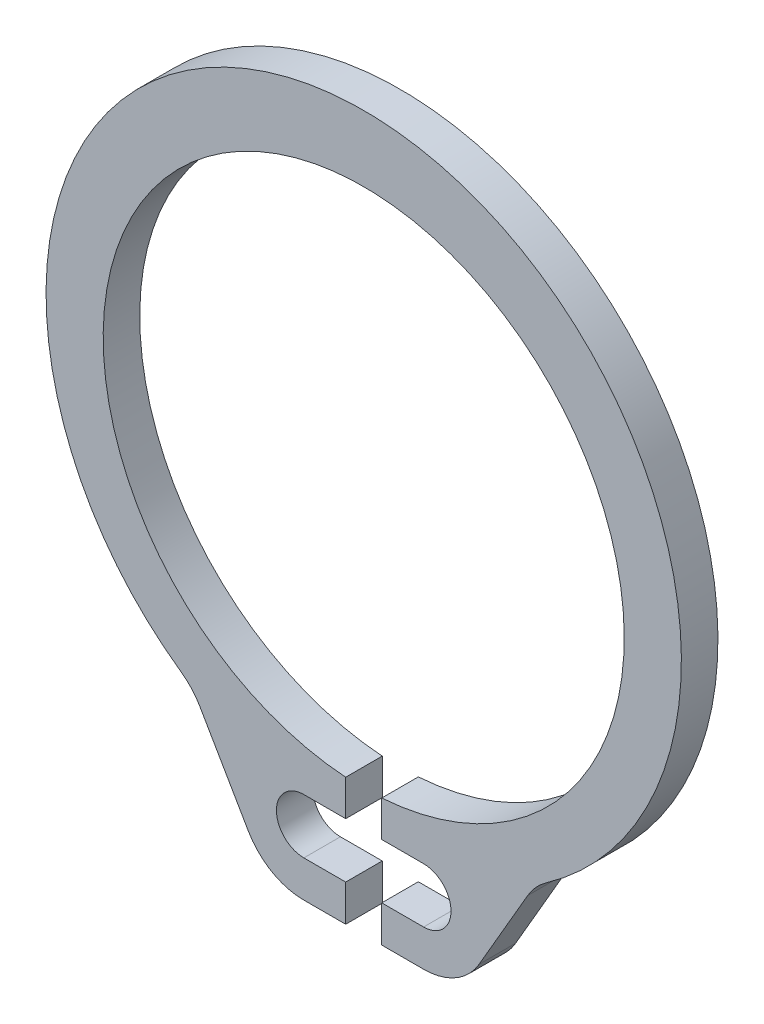
ISO-10303-21;
HEADER;
FILE_DESCRIPTION(('STEP AP214'),'2;1');
FILE_NAME('part.step','',(''),(''),'','','');
FILE_SCHEMA(('AUTOMOTIVE_DESIGN { 1 0 10303 214 1 1 1 1 }'));
ENDSEC;
DATA;
#1=APPLICATION_CONTEXT('core data for automotive mechanical design processes');
#2=APPLICATION_PROTOCOL_DEFINITION('international standard','automotive_design',2000,#1);
#3=PRODUCT_CONTEXT('',#1,'mechanical');
#4=PRODUCT('Part','Part','',(#3));
#5=PRODUCT_RELATED_PRODUCT_CATEGORY('part','',(#4));
#6=PRODUCT_DEFINITION_FORMATION('','',#4);
#7=PRODUCT_DEFINITION_CONTEXT('part definition',#1,'design');
#8=PRODUCT_DEFINITION('design','',#6,#7);
#9=PRODUCT_DEFINITION_SHAPE('','',#8);
#10=(LENGTH_UNIT() NAMED_UNIT(*) SI_UNIT(.MILLI.,.METRE.));
#11=(NAMED_UNIT(*) PLANE_ANGLE_UNIT() SI_UNIT($,.RADIAN.));
#12=(NAMED_UNIT(*) SI_UNIT($,.STERADIAN.) SOLID_ANGLE_UNIT());
#13=UNCERTAINTY_MEASURE_WITH_UNIT(LENGTH_MEASURE(1.E-05),#10,'distance_accuracy_value','');
#14=(GEOMETRIC_REPRESENTATION_CONTEXT(3) GLOBAL_UNCERTAINTY_ASSIGNED_CONTEXT((#13)) GLOBAL_UNIT_ASSIGNED_CONTEXT((#10,
#11,#12)) REPRESENTATION_CONTEXT('',''));
#15=CARTESIAN_POINT('',(0.,0.,0.));
#16=DIRECTION('',(0.,0.,1.));
#17=DIRECTION('',(1.,0.,0.));
#18=AXIS2_PLACEMENT_3D('',#15,#16,#17);
#19=CARTESIAN_POINT('',(-0.197180873665502,-2.84317071296477,0.2));
#20=DIRECTION('',(1.,0.,0.));
#21=DIRECTION('',(0.,0.,-1.));
#22=AXIS2_PLACEMENT_3D('',#19,#20,#21);
#23=PLANE('',#22);
#24=DIRECTION('',(0.,-1.,0.));
#25=VECTOR('',#24,1.);
#26=CARTESIAN_POINT('',(-0.197180873665502,-2.84317071296477,-0.2));
#27=LINE('',#26,#25);
#28=CARTESIAN_POINT('',(-0.1971808736655,-2.84317071296476,-0.2));
#29=VERTEX_POINT('',#28);
#30=CARTESIAN_POINT('',(-0.197180873665502,-3.23646186214265,-0.2));
#31=VERTEX_POINT('',#30);
#32=EDGE_CURVE('E294',#29,#31,#27,.T.);
#33=ORIENTED_EDGE('',*,*,#32,.F.);
#34=DIRECTION('',(0.,0.,-1.));
#35=VECTOR('',#34,1.);
#36=CARTESIAN_POINT('',(-0.1971808736655,-2.84317071296476,0.2));
#37=LINE('',#36,#35);
#38=CARTESIAN_POINT('',(-0.1971808736655,-2.84317071296476,0.2));
#39=VERTEX_POINT('',#38);
#40=EDGE_CURVE('E11',#39,#29,#37,.T.);
#41=ORIENTED_EDGE('',*,*,#40,.F.);
#42=DIRECTION('',(0.,-1.,0.));
#43=VECTOR('',#42,1.);
#44=CARTESIAN_POINT('',(-0.197180873665502,-2.84317071296477,0.2));
#45=LINE('',#44,#43);
#46=CARTESIAN_POINT('',(-0.197180873665502,-3.23646186214265,0.2));
#47=VERTEX_POINT('',#46);
#48=EDGE_CURVE('E225',#39,#47,#45,.T.);
#49=ORIENTED_EDGE('',*,*,#48,.T.);
#50=DIRECTION('',(0.,0.,-1.));
#51=VECTOR('',#50,1.);
#52=CARTESIAN_POINT('',(-0.197180873665502,-3.23646186214265,0.2));
#53=LINE('',#52,#51);
#54=EDGE_CURVE('E300',#47,#31,#53,.T.);
#55=ORIENTED_EDGE('',*,*,#54,.T.);
#56=EDGE_LOOP('',(#33,#41,#49,#55));
#57=FACE_BOUND('',#56,.T.);
#58=ADVANCED_FACE('F17',(#57),#23,.T.);
#59=CARTESIAN_POINT('',(0.,0.,0.2));
#60=DIRECTION('',(0.,0.,-1.));
#61=DIRECTION('',(-1.,0.,0.));
#62=AXIS2_PLACEMENT_3D('',#59,#60,#61);
#63=CYLINDRICAL_SURFACE('',#62,2.85);
#64=CARTESIAN_POINT('',(0.,0.,-0.2));
#65=DIRECTION('',(0.,0.,1.));
#66=DIRECTION('',(1.,0.,0.));
#67=AXIS2_PLACEMENT_3D('',#64,#65,#66);
#68=CIRCLE('',#67,2.85);
#69=CARTESIAN_POINT('',(0.197180873665501,-2.84317071296476,-0.2));
#70=VERTEX_POINT('',#69);
#71=EDGE_CURVE('E217',#70,#29,#68,.T.);
#72=ORIENTED_EDGE('',*,*,#71,.F.);
#73=DIRECTION('',(0.,0.,-1.));
#74=VECTOR('',#73,1.);
#75=CARTESIAN_POINT('',(0.197180873665501,-2.84317071296476,0.2));
#76=LINE('',#75,#74);
#77=CARTESIAN_POINT('',(0.197180873665501,-2.84317071296476,0.2));
#78=VERTEX_POINT('',#77);
#79=EDGE_CURVE('E20',#78,#70,#76,.T.);
#80=ORIENTED_EDGE('',*,*,#79,.F.);
#81=CARTESIAN_POINT('',(0.,0.,0.2));
#82=DIRECTION('',(0.,0.,1.));
#83=DIRECTION('',(1.,0.,0.));
#84=AXIS2_PLACEMENT_3D('',#81,#82,#83);
#85=CIRCLE('',#84,2.85);
#86=EDGE_CURVE('E297',#78,#39,#85,.T.);
#87=ORIENTED_EDGE('',*,*,#86,.T.);
#88=ORIENTED_EDGE('',*,*,#40,.T.);
#89=EDGE_LOOP('',(#72,#80,#87,#88));
#90=FACE_BOUND('',#89,.T.);
#91=ADVANCED_FACE('F223',(#90),#63,.F.);
#92=CARTESIAN_POINT('',(0.197180873665502,-2.84317071296477,0.2));
#93=DIRECTION('',(1.,0.,0.));
#94=DIRECTION('',(0.,0.,-1.));
#95=AXIS2_PLACEMENT_3D('',#92,#93,#94);
#96=PLANE('',#95);
#97=DIRECTION('',(0.,-1.,0.));
#98=VECTOR('',#97,1.);
#99=CARTESIAN_POINT('',(0.197180873665502,-2.84317071296477,-0.2));
#100=LINE('',#99,#98);
#101=CARTESIAN_POINT('',(0.197180873665502,-3.23646186214265,-0.2));
#102=VERTEX_POINT('',#101);
#103=EDGE_CURVE('E204',#70,#102,#100,.T.);
#104=ORIENTED_EDGE('',*,*,#103,.T.);
#105=DIRECTION('',(0.,0.,-1.));
#106=VECTOR('',#105,1.);
#107=CARTESIAN_POINT('',(0.197180873665502,-3.23646186214265,0.2));
#108=LINE('',#107,#106);
#109=CARTESIAN_POINT('',(0.197180873665502,-3.23646186214265,0.2));
#110=VERTEX_POINT('',#109);
#111=EDGE_CURVE('E212',#110,#102,#108,.T.);
#112=ORIENTED_EDGE('',*,*,#111,.F.);
#113=DIRECTION('',(0.,-1.,0.));
#114=VECTOR('',#113,1.);
#115=CARTESIAN_POINT('',(0.197180873665502,-2.84317071296477,0.2));
#116=LINE('',#115,#114);
#117=EDGE_CURVE('E206',#78,#110,#116,.T.);
#118=ORIENTED_EDGE('',*,*,#117,.F.);
#119=ORIENTED_EDGE('',*,*,#79,.T.);
#120=EDGE_LOOP('',(#104,#112,#118,#119));
#121=FACE_BOUND('',#120,.T.);
#122=ADVANCED_FACE('F202',(#121),#96,.F.);
#123=CARTESIAN_POINT('',(0.654781059878474,-3.23646186214265,0.2));
#124=DIRECTION('',(0.,-1.,0.));
#125=DIRECTION('',(0.,0.,-1.));
#126=AXIS2_PLACEMENT_3D('',#123,#124,#125);
#127=PLANE('',#126);
#128=DIRECTION('',(-1.,0.,0.));
#129=VECTOR('',#128,1.);
#130=CARTESIAN_POINT('',(0.654781059878474,-3.23646186214265,-0.2));
#131=LINE('',#130,#129);
#132=CARTESIAN_POINT('',(0.654781059878474,-3.23646186214265,-0.2));
#133=VERTEX_POINT('',#132);
#134=EDGE_CURVE('E220',#133,#102,#131,.T.);
#135=ORIENTED_EDGE('',*,*,#134,.F.);
#136=DIRECTION('',(0.,0.,-1.));
#137=VECTOR('',#136,1.);
#138=CARTESIAN_POINT('',(0.654781059878474,-3.23646186214265,0.2));
#139=LINE('',#138,#137);
#140=CARTESIAN_POINT('',(0.654781059878474,-3.23646186214265,0.2));
#141=VERTEX_POINT('',#140);
#142=EDGE_CURVE('E410',#141,#133,#139,.T.);
#143=ORIENTED_EDGE('',*,*,#142,.F.);
#144=DIRECTION('',(-1.,0.,0.));
#145=VECTOR('',#144,1.);
#146=CARTESIAN_POINT('',(0.654781059878474,-3.23646186214265,0.2));
#147=LINE('',#146,#145);
#148=EDGE_CURVE('E303',#141,#110,#147,.T.);
#149=ORIENTED_EDGE('',*,*,#148,.T.);
#150=ORIENTED_EDGE('',*,*,#111,.T.);
#151=EDGE_LOOP('',(#135,#143,#149,#150));
#152=FACE_BOUND('',#151,.T.);
#153=ADVANCED_FACE('F416',(#152),#127,.T.);
#154=CARTESIAN_POINT('',(0.654781059878474,-3.53646186214266,0.2));
#155=DIRECTION('',(0.,0.,-1.));
#156=DIRECTION('',(-1.,0.,0.));
#157=AXIS2_PLACEMENT_3D('',#154,#155,#156);
#158=CYLINDRICAL_SURFACE('',#157,0.3);
#159=CARTESIAN_POINT('',(0.654781059878474,-3.53646186214266,-0.2));
#160=DIRECTION('',(0.,0.,1.));
#161=DIRECTION('',(1.,0.,0.));
#162=AXIS2_PLACEMENT_3D('',#159,#160,#161);
#163=CIRCLE('',#162,0.3);
#164=CARTESIAN_POINT('',(0.654781059878474,-3.83646186214266,-0.2));
#165=VERTEX_POINT('',#164);
#166=EDGE_CURVE('E235',#165,#133,#163,.T.);
#167=ORIENTED_EDGE('',*,*,#166,.F.);
#168=DIRECTION('',(0.,0.,-1.));
#169=VECTOR('',#168,1.);
#170=CARTESIAN_POINT('',(0.654781059878474,-3.83646186214266,0.2));
#171=LINE('',#170,#169);
#172=CARTESIAN_POINT('',(0.654781059878474,-3.83646186214266,0.2));
#173=VERTEX_POINT('',#172);
#174=EDGE_CURVE('E407',#173,#165,#171,.T.);
#175=ORIENTED_EDGE('',*,*,#174,.F.);
#176=CARTESIAN_POINT('',(0.654781059878474,-3.53646186214266,0.2));
#177=DIRECTION('',(0.,0.,1.));
#178=DIRECTION('',(1.,0.,0.));
#179=AXIS2_PLACEMENT_3D('',#176,#177,#178);
#180=CIRCLE('',#179,0.3);
#181=EDGE_CURVE('E307',#173,#141,#180,.T.);
#182=ORIENTED_EDGE('',*,*,#181,.T.);
#183=ORIENTED_EDGE('',*,*,#142,.T.);
#184=EDGE_LOOP('',(#167,#175,#182,#183));
#185=FACE_BOUND('',#184,.T.);
#186=ADVANCED_FACE('F422',(#185),#158,.F.);
#187=CARTESIAN_POINT('',(0.654781059878474,-3.83646186214267,0.2));
#188=DIRECTION('',(0.,-1.,0.));
#189=DIRECTION('',(0.,0.,-1.));
#190=AXIS2_PLACEMENT_3D('',#187,#188,#189);
#191=PLANE('',#190);
#192=DIRECTION('',(-1.,0.,0.));
#193=VECTOR('',#192,1.);
#194=CARTESIAN_POINT('',(0.654781059878474,-3.83646186214267,-0.2));
#195=LINE('',#194,#193);
#196=CARTESIAN_POINT('',(0.197180873665502,-3.83646186214267,-0.2));
#197=VERTEX_POINT('',#196);
#198=EDGE_CURVE('E238',#165,#197,#195,.T.);
#199=ORIENTED_EDGE('',*,*,#198,.T.);
#200=DIRECTION('',(0.,0.,-1.));
#201=VECTOR('',#200,1.);
#202=CARTESIAN_POINT('',(0.197180873665502,-3.83646186214267,0.2));
#203=LINE('',#202,#201);
#204=CARTESIAN_POINT('',(0.197180873665502,-3.83646186214267,0.2));
#205=VERTEX_POINT('',#204);
#206=EDGE_CURVE('E403',#205,#197,#203,.T.);
#207=ORIENTED_EDGE('',*,*,#206,.F.);
#208=DIRECTION('',(-1.,0.,0.));
#209=VECTOR('',#208,1.);
#210=CARTESIAN_POINT('',(0.654781059878474,-3.83646186214267,0.2));
#211=LINE('',#210,#209);
#212=EDGE_CURVE('E311',#173,#205,#211,.T.);
#213=ORIENTED_EDGE('',*,*,#212,.F.);
#214=ORIENTED_EDGE('',*,*,#174,.T.);
#215=EDGE_LOOP('',(#199,#207,#213,#214));
#216=FACE_BOUND('',#215,.T.);
#217=ADVANCED_FACE('F427',(#216),#191,.F.);
#218=CARTESIAN_POINT('',(0.197180873665502,-3.83646186214264,0.2));
#219=DIRECTION('',(1.,0.,0.));
#220=DIRECTION('',(0.,0.,-1.));
#221=AXIS2_PLACEMENT_3D('',#218,#219,#220);
#222=PLANE('',#221);
#223=DIRECTION('',(0.,-1.,0.));
#224=VECTOR('',#223,1.);
#225=CARTESIAN_POINT('',(0.197180873665502,-3.83646186214264,-0.2));
#226=LINE('',#225,#224);
#227=CARTESIAN_POINT('',(0.197180873665502,-4.23650310489373,-0.2));
#228=VERTEX_POINT('',#227);
#229=EDGE_CURVE('E241',#197,#228,#226,.T.);
#230=ORIENTED_EDGE('',*,*,#229,.T.);
#231=DIRECTION('',(0.,0.,-1.));
#232=VECTOR('',#231,1.);
#233=CARTESIAN_POINT('',(0.197180873665502,-4.23650310489373,0.2));
#234=LINE('',#233,#232);
#235=CARTESIAN_POINT('',(0.197180873665502,-4.23650310489373,0.2));
#236=VERTEX_POINT('',#235);
#237=EDGE_CURVE('E399',#236,#228,#234,.T.);
#238=ORIENTED_EDGE('',*,*,#237,.F.);
#239=DIRECTION('',(0.,-1.,0.));
#240=VECTOR('',#239,1.);
#241=CARTESIAN_POINT('',(0.197180873665502,-3.83646186214264,0.2));
#242=LINE('',#241,#240);
#243=EDGE_CURVE('E314',#205,#236,#242,.T.);
#244=ORIENTED_EDGE('',*,*,#243,.F.);
#245=ORIENTED_EDGE('',*,*,#206,.T.);
#246=EDGE_LOOP('',(#230,#238,#244,#245));
#247=FACE_BOUND('',#246,.T.);
#248=ADVANCED_FACE('F433',(#247),#222,.F.);
#249=CARTESIAN_POINT('',(0.197180873665502,-4.23650310489373,0.2));
#250=DIRECTION('',(0.,1.,0.));
#251=DIRECTION('',(0.,0.,1.));
#252=AXIS2_PLACEMENT_3D('',#249,#250,#251);
#253=PLANE('',#252);
#254=DIRECTION('',(1.,0.,0.));
#255=VECTOR('',#254,1.);
#256=CARTESIAN_POINT('',(0.197180873665502,-4.23650310489373,-0.2));
#257=LINE('',#256,#255);
#258=CARTESIAN_POINT('',(0.655583102560456,-4.23650310489373,-0.2));
#259=VERTEX_POINT('',#258);
#260=EDGE_CURVE('E244',#228,#259,#257,.T.);
#261=ORIENTED_EDGE('',*,*,#260,.T.);
#262=DIRECTION('',(0.,0.,-1.));
#263=VECTOR('',#262,1.);
#264=CARTESIAN_POINT('',(0.655583102560456,-4.23650310489373,0.2));
#265=LINE('',#264,#263);
#266=CARTESIAN_POINT('',(0.655583102560456,-4.23650310489373,0.2));
#267=VERTEX_POINT('',#266);
#268=EDGE_CURVE('E395',#267,#259,#265,.T.);
#269=ORIENTED_EDGE('',*,*,#268,.F.);
#270=DIRECTION('',(1.,0.,0.));
#271=VECTOR('',#270,1.);
#272=CARTESIAN_POINT('',(0.197180873665502,-4.23650310489373,0.2));
#273=LINE('',#272,#271);
#274=EDGE_CURVE('E317',#236,#267,#273,.T.);
#275=ORIENTED_EDGE('',*,*,#274,.F.);
#276=ORIENTED_EDGE('',*,*,#237,.T.);
#277=EDGE_LOOP('',(#261,#269,#275,#276));
#278=FACE_BOUND('',#277,.T.);
#279=ADVANCED_FACE('F437',(#278),#253,.F.);
#280=CARTESIAN_POINT('',(0.655583102560456,-3.53650310489374,0.2));
#281=DIRECTION('',(0.,0.,-1.));
#282=DIRECTION('',(-1.,0.,0.));
#283=AXIS2_PLACEMENT_3D('',#280,#281,#282);
#284=CYLINDRICAL_SURFACE('',#283,0.7);
#285=CARTESIAN_POINT('',(0.655583102560456,-3.53650310489374,-0.2));
#286=DIRECTION('',(0.,0.,1.));
#287=DIRECTION('',(1.,0.,0.));
#288=AXIS2_PLACEMENT_3D('',#285,#286,#287);
#289=CIRCLE('',#288,0.7);
#290=CARTESIAN_POINT('',(1.26121867382212,-3.887509593185,-0.2));
#291=VERTEX_POINT('',#290);
#292=EDGE_CURVE('E247',#259,#291,#289,.T.);
#293=ORIENTED_EDGE('',*,*,#292,.T.);
#294=DIRECTION('',(0.,0.,-1.));
#295=VECTOR('',#294,1.);
#296=CARTESIAN_POINT('',(1.26121867382212,-3.887509593185,0.2));
#297=LINE('',#296,#295);
#298=CARTESIAN_POINT('',(1.26121867382212,-3.887509593185,0.2));
#299=VERTEX_POINT('',#298);
#300=EDGE_CURVE('E391',#299,#291,#297,.T.);
#301=ORIENTED_EDGE('',*,*,#300,.F.);
#302=CARTESIAN_POINT('',(0.655583102560456,-3.53650310489374,0.2));
#303=DIRECTION('',(0.,0.,1.));
#304=DIRECTION('',(1.,0.,0.));
#305=AXIS2_PLACEMENT_3D('',#302,#303,#304);
#306=CIRCLE('',#305,0.7);
#307=EDGE_CURVE('E320',#267,#299,#306,.T.);
#308=ORIENTED_EDGE('',*,*,#307,.F.);
#309=ORIENTED_EDGE('',*,*,#268,.T.);
#310=EDGE_LOOP('',(#293,#301,#308,#309));
#311=FACE_BOUND('',#310,.T.);
#312=ADVANCED_FACE('F442',(#311),#284,.T.);
#313=CARTESIAN_POINT('',(1.26121867382213,-3.887509593185,0.2));
#314=DIRECTION('',(-0.865193673230945,0.501437840416083,0.));
#315=DIRECTION('',(-0.501437840416083,-0.865193673230945,0.));
#316=AXIS2_PLACEMENT_3D('',#313,#314,#315);
#317=PLANE('',#316);
#318=DIRECTION('',(0.501437840416083,0.865193673230945,0.));
#319=VECTOR('',#318,1.);
#320=CARTESIAN_POINT('',(1.26121867382213,-3.887509593185,-0.2));
#321=LINE('',#320,#319);
#322=CARTESIAN_POINT('',(1.79425129082074,-2.96780148445859,-0.2));
#323=VERTEX_POINT('',#322);
#324=EDGE_CURVE('E250',#291,#323,#321,.T.);
#325=ORIENTED_EDGE('',*,*,#324,.T.);
#326=DIRECTION('',(0.,0.,-1.));
#327=VECTOR('',#326,1.);
#328=CARTESIAN_POINT('',(1.79425129082074,-2.96780148445859,0.2));
#329=LINE('',#328,#327);
#330=CARTESIAN_POINT('',(1.79425129082074,-2.96780148445859,0.2));
#331=VERTEX_POINT('',#330);
#332=EDGE_CURVE('E388',#331,#323,#329,.T.);
#333=ORIENTED_EDGE('',*,*,#332,.F.);
#334=DIRECTION('',(0.501437840416083,0.865193673230945,0.));
#335=VECTOR('',#334,1.);
#336=CARTESIAN_POINT('',(1.26121867382213,-3.887509593185,0.2));
#337=LINE('',#336,#335);
#338=EDGE_CURVE('E323',#299,#331,#337,.T.);
#339=ORIENTED_EDGE('',*,*,#338,.F.);
#340=ORIENTED_EDGE('',*,*,#300,.T.);
#341=EDGE_LOOP('',(#325,#333,#339,#340));
#342=FACE_BOUND('',#341,.T.);
#343=ADVANCED_FACE('F447',(#342),#317,.F.);
#344=CARTESIAN_POINT('',(2.39988686208238,-3.31880797274983,0.2));
#345=DIRECTION('',(0.,0.,-1.));
#346=DIRECTION('',(-1.,0.,0.));
#347=AXIS2_PLACEMENT_3D('',#344,#345,#346);
#348=CYLINDRICAL_SURFACE('',#347,0.7);
#349=CARTESIAN_POINT('',(2.39988686208238,-3.31880797274983,-0.2));
#350=DIRECTION('',(0.,0.,1.));
#351=DIRECTION('',(1.,0.,0.));
#352=AXIS2_PLACEMENT_3D('',#349,#350,#351);
#353=CIRCLE('',#352,0.7);
#354=CARTESIAN_POINT('',(1.99751062173317,-2.74601362815272,-0.2));
#355=VERTEX_POINT('',#354);
#356=EDGE_CURVE('E254',#355,#323,#353,.T.);
#357=ORIENTED_EDGE('',*,*,#356,.F.);
#358=DIRECTION('',(0.,0.,-1.));
#359=VECTOR('',#358,1.);
#360=CARTESIAN_POINT('',(1.99751062173317,-2.74601362815272,0.2));
#361=LINE('',#360,#359);
#362=CARTESIAN_POINT('',(1.99751062173317,-2.74601362815272,0.2));
#363=VERTEX_POINT('',#362);
#364=EDGE_CURVE('E385',#363,#355,#361,.T.);
#365=ORIENTED_EDGE('',*,*,#364,.F.);
#366=CARTESIAN_POINT('',(2.39988686208238,-3.31880797274983,0.2));
#367=DIRECTION('',(0.,0.,1.));
#368=DIRECTION('',(1.,0.,0.));
#369=AXIS2_PLACEMENT_3D('',#366,#367,#368);
#370=CIRCLE('',#369,0.7);
#371=EDGE_CURVE('E326',#363,#331,#370,.T.);
#372=ORIENTED_EDGE('',*,*,#371,.T.);
#373=ORIENTED_EDGE('',*,*,#332,.T.);
#374=EDGE_LOOP('',(#357,#365,#372,#373));
#375=FACE_BOUND('',#374,.T.);
#376=ADVANCED_FACE('F451',(#375),#348,.F.);
#377=CARTESIAN_POINT('',(0.,0.0975011539537434,0.2));
#378=DIRECTION('',(0.,0.,-1.));
#379=DIRECTION('',(-1.,0.,0.));
#380=AXIS2_PLACEMENT_3D('',#377,#378,#379);
#381=CYLINDRICAL_SURFACE('',#380,3.475);
#382=CARTESIAN_POINT('',(0.,0.0975011539537434,-0.2));
#383=DIRECTION('',(0.,0.,1.));
#384=DIRECTION('',(1.,0.,0.));
#385=AXIS2_PLACEMENT_3D('',#382,#383,#384);
#386=CIRCLE('',#385,3.475);
#387=CARTESIAN_POINT('',(-1.99751062173359,-2.74601362815334,-0.2));
#388=VERTEX_POINT('',#387);
#389=EDGE_CURVE('E258',#355,#388,#386,.T.);
#390=ORIENTED_EDGE('',*,*,#389,.T.);
#391=DIRECTION('',(0.,0.,-1.));
#392=VECTOR('',#391,1.);
#393=CARTESIAN_POINT('',(-1.99751062173359,-2.74601362815334,0.2));
#394=LINE('',#393,#392);
#395=CARTESIAN_POINT('',(-1.99751062173359,-2.74601362815334,0.2));
#396=VERTEX_POINT('',#395);
#397=EDGE_CURVE('E382',#396,#388,#394,.T.);
#398=ORIENTED_EDGE('',*,*,#397,.F.);
#399=CARTESIAN_POINT('',(0.,0.0975011539537434,0.2));
#400=DIRECTION('',(0.,0.,1.));
#401=DIRECTION('',(1.,0.,0.));
#402=AXIS2_PLACEMENT_3D('',#399,#400,#401);
#403=CIRCLE('',#402,3.475);
#404=EDGE_CURVE('E330',#363,#396,#403,.T.);
#405=ORIENTED_EDGE('',*,*,#404,.F.);
#406=ORIENTED_EDGE('',*,*,#364,.T.);
#407=EDGE_LOOP('',(#390,#398,#405,#406));
#408=FACE_BOUND('',#407,.T.);
#409=ADVANCED_FACE('F456',(#408),#381,.T.);
#410=CARTESIAN_POINT('',(-2.39988686208238,-3.31880797274983,0.2));
#411=DIRECTION('',(0.,0.,-1.));
#412=DIRECTION('',(-1.,0.,0.));
#413=AXIS2_PLACEMENT_3D('',#410,#411,#412);
#414=CYLINDRICAL_SURFACE('',#413,0.7);
#415=CARTESIAN_POINT('',(-2.39988686208238,-3.31880797274983,-0.2));
#416=DIRECTION('',(0.,0.,1.));
#417=DIRECTION('',(1.,0.,0.));
#418=AXIS2_PLACEMENT_3D('',#415,#416,#417);
#419=CIRCLE('',#418,0.7);
#420=CARTESIAN_POINT('',(-1.79425129082072,-2.96780148445858,-0.2));
#421=VERTEX_POINT('',#420);
#422=EDGE_CURVE('E262',#421,#388,#419,.T.);
#423=ORIENTED_EDGE('',*,*,#422,.F.);
#424=DIRECTION('',(0.,0.,-1.));
#425=VECTOR('',#424,1.);
#426=CARTESIAN_POINT('',(-1.79425129082072,-2.96780148445858,0.2));
#427=LINE('',#426,#425);
#428=CARTESIAN_POINT('',(-1.79425129082072,-2.96780148445858,0.2));
#429=VERTEX_POINT('',#428);
#430=EDGE_CURVE('E379',#429,#421,#427,.T.);
#431=ORIENTED_EDGE('',*,*,#430,.F.);
#432=CARTESIAN_POINT('',(-2.39988686208238,-3.31880797274983,0.2));
#433=DIRECTION('',(0.,0.,1.));
#434=DIRECTION('',(1.,0.,0.));
#435=AXIS2_PLACEMENT_3D('',#432,#433,#434);
#436=CIRCLE('',#435,0.7);
#437=EDGE_CURVE('E333',#429,#396,#436,.T.);
#438=ORIENTED_EDGE('',*,*,#437,.T.);
#439=ORIENTED_EDGE('',*,*,#397,.T.);
#440=EDGE_LOOP('',(#423,#431,#438,#439));
#441=FACE_BOUND('',#440,.T.);
#442=ADVANCED_FACE('F516',(#441),#414,.F.);
#443=CARTESIAN_POINT('',(-1.26121867382213,-3.887509593185,0.2));
#444=DIRECTION('',(-0.865193673230945,-0.501437840416083,0.));
#445=DIRECTION('',(0.501437840416083,-0.865193673230945,0.));
#446=AXIS2_PLACEMENT_3D('',#443,#444,#445);
#447=PLANE('',#446);
#448=DIRECTION('',(-0.501437840416083,0.865193673230945,0.));
#449=VECTOR('',#448,1.);
#450=CARTESIAN_POINT('',(-1.26121867382213,-3.887509593185,-0.2));
#451=LINE('',#450,#449);
#452=CARTESIAN_POINT('',(-1.26121867382213,-3.887509593185,-0.2));
#453=VERTEX_POINT('',#452);
#454=EDGE_CURVE('E266',#453,#421,#451,.T.);
#455=ORIENTED_EDGE('',*,*,#454,.F.);
#456=DIRECTION('',(0.,0.,-1.));
#457=VECTOR('',#456,1.);
#458=CARTESIAN_POINT('',(-1.26121867382213,-3.887509593185,0.2));
#459=LINE('',#458,#457);
#460=CARTESIAN_POINT('',(-1.26121867382213,-3.887509593185,0.2));
#461=VERTEX_POINT('',#460);
#462=EDGE_CURVE('E376',#461,#453,#459,.T.);
#463=ORIENTED_EDGE('',*,*,#462,.F.);
#464=DIRECTION('',(-0.501437840416083,0.865193673230945,0.));
#465=VECTOR('',#464,1.);
#466=CARTESIAN_POINT('',(-1.26121867382213,-3.887509593185,0.2));
#467=LINE('',#466,#465);
#468=EDGE_CURVE('E337',#461,#429,#467,.T.);
#469=ORIENTED_EDGE('',*,*,#468,.T.);
#470=ORIENTED_EDGE('',*,*,#430,.T.);
#471=EDGE_LOOP('',(#455,#463,#469,#470));
#472=FACE_BOUND('',#471,.T.);
#473=ADVANCED_FACE('F462',(#472),#447,.T.);
#474=CARTESIAN_POINT('',(-0.655583102560456,-3.53650310489374,0.2));
#475=DIRECTION('',(0.,0.,-1.));
#476=DIRECTION('',(-1.,0.,0.));
#477=AXIS2_PLACEMENT_3D('',#474,#475,#476);
#478=CYLINDRICAL_SURFACE('',#477,0.7);
#479=CARTESIAN_POINT('',(-0.655583102560456,-3.53650310489374,-0.2));
#480=DIRECTION('',(0.,0.,1.));
#481=DIRECTION('',(1.,0.,0.));
#482=AXIS2_PLACEMENT_3D('',#479,#480,#481);
#483=CIRCLE('',#482,0.7);
#484=CARTESIAN_POINT('',(-0.655583102560456,-4.23650310489374,-0.2));
#485=VERTEX_POINT('',#484);
#486=EDGE_CURVE('E270',#453,#485,#483,.T.);
#487=ORIENTED_EDGE('',*,*,#486,.T.);
#488=DIRECTION('',(0.,0.,-1.));
#489=VECTOR('',#488,1.);
#490=CARTESIAN_POINT('',(-0.655583102560456,-4.23650310489374,0.2));
#491=LINE('',#490,#489);
#492=CARTESIAN_POINT('',(-0.655583102560456,-4.23650310489374,0.2));
#493=VERTEX_POINT('',#492);
#494=EDGE_CURVE('E373',#493,#485,#491,.T.);
#495=ORIENTED_EDGE('',*,*,#494,.F.);
#496=CARTESIAN_POINT('',(-0.655583102560456,-3.53650310489374,0.2));
#497=DIRECTION('',(0.,0.,1.));
#498=DIRECTION('',(1.,0.,0.));
#499=AXIS2_PLACEMENT_3D('',#496,#497,#498);
#500=CIRCLE('',#499,0.7);
#501=EDGE_CURVE('E341',#461,#493,#500,.T.);
#502=ORIENTED_EDGE('',*,*,#501,.F.);
#503=ORIENTED_EDGE('',*,*,#462,.T.);
#504=EDGE_LOOP('',(#487,#495,#502,#503));
#505=FACE_BOUND('',#504,.T.);
#506=ADVANCED_FACE('F468',(#505),#478,.T.);
#507=CARTESIAN_POINT('',(-0.197180873665502,-4.23650310489373,0.2));
#508=DIRECTION('',(0.,-1.,0.));
#509=DIRECTION('',(0.,0.,-1.));
#510=AXIS2_PLACEMENT_3D('',#507,#508,#509);
#511=PLANE('',#510);
#512=DIRECTION('',(-1.,0.,0.));
#513=VECTOR('',#512,1.);
#514=CARTESIAN_POINT('',(-0.197180873665502,-4.23650310489373,-0.2));
#515=LINE('',#514,#513);
#516=CARTESIAN_POINT('',(-0.197180873665502,-4.23650310489373,-0.2));
#517=VERTEX_POINT('',#516);
#518=EDGE_CURVE('E274',#517,#485,#515,.T.);
#519=ORIENTED_EDGE('',*,*,#518,.F.);
#520=DIRECTION('',(0.,0.,-1.));
#521=VECTOR('',#520,1.);
#522=CARTESIAN_POINT('',(-0.197180873665502,-4.23650310489373,0.2));
#523=LINE('',#522,#521);
#524=CARTESIAN_POINT('',(-0.197180873665502,-4.23650310489373,0.2));
#525=VERTEX_POINT('',#524);
#526=EDGE_CURVE('E370',#525,#517,#523,.T.);
#527=ORIENTED_EDGE('',*,*,#526,.F.);
#528=DIRECTION('',(-1.,0.,0.));
#529=VECTOR('',#528,1.);
#530=CARTESIAN_POINT('',(-0.197180873665502,-4.23650310489373,0.2));
#531=LINE('',#530,#529);
#532=EDGE_CURVE('E344',#525,#493,#531,.T.);
#533=ORIENTED_EDGE('',*,*,#532,.T.);
#534=ORIENTED_EDGE('',*,*,#494,.T.);
#535=EDGE_LOOP('',(#519,#527,#533,#534));
#536=FACE_BOUND('',#535,.T.);
#537=ADVANCED_FACE('F523',(#536),#511,.T.);
#538=CARTESIAN_POINT('',(-0.197180873665502,-3.83646186214264,0.2));
#539=DIRECTION('',(1.,0.,0.));
#540=DIRECTION('',(0.,0.,-1.));
#541=AXIS2_PLACEMENT_3D('',#538,#539,#540);
#542=PLANE('',#541);
#543=DIRECTION('',(0.,-1.,0.));
#544=VECTOR('',#543,1.);
#545=CARTESIAN_POINT('',(-0.197180873665502,-3.83646186214264,-0.2));
#546=LINE('',#545,#544);
#547=CARTESIAN_POINT('',(-0.197180873665502,-3.83646186214264,-0.2));
#548=VERTEX_POINT('',#547);
#549=EDGE_CURVE('E278',#548,#517,#546,.T.);
#550=ORIENTED_EDGE('',*,*,#549,.F.);
#551=DIRECTION('',(0.,0.,-1.));
#552=VECTOR('',#551,1.);
#553=CARTESIAN_POINT('',(-0.197180873665502,-3.83646186214264,0.2));
#554=LINE('',#553,#552);
#555=CARTESIAN_POINT('',(-0.197180873665502,-3.83646186214264,0.2));
#556=VERTEX_POINT('',#555);
#557=EDGE_CURVE('E367',#556,#548,#554,.T.);
#558=ORIENTED_EDGE('',*,*,#557,.F.);
#559=DIRECTION('',(0.,-1.,0.));
#560=VECTOR('',#559,1.);
#561=CARTESIAN_POINT('',(-0.197180873665502,-3.83646186214264,0.2));
#562=LINE('',#561,#560);
#563=EDGE_CURVE('E348',#556,#525,#562,.T.);
#564=ORIENTED_EDGE('',*,*,#563,.T.);
#565=ORIENTED_EDGE('',*,*,#526,.T.);
#566=EDGE_LOOP('',(#550,#558,#564,#565));
#567=FACE_BOUND('',#566,.T.);
#568=ADVANCED_FACE('F475',(#567),#542,.T.);
#569=CARTESIAN_POINT('',(-0.654781059878474,-3.83646186214267,0.2));
#570=DIRECTION('',(0.,1.,0.));
#571=DIRECTION('',(0.,0.,1.));
#572=AXIS2_PLACEMENT_3D('',#569,#570,#571);
#573=PLANE('',#572);
#574=DIRECTION('',(1.,0.,0.));
#575=VECTOR('',#574,1.);
#576=CARTESIAN_POINT('',(-0.654781059878474,-3.83646186214267,-0.2));
#577=LINE('',#576,#575);
#578=CARTESIAN_POINT('',(-0.654781059878474,-3.83646186214267,-0.2));
#579=VERTEX_POINT('',#578);
#580=EDGE_CURVE('E282',#579,#548,#577,.T.);
#581=ORIENTED_EDGE('',*,*,#580,.F.);
#582=DIRECTION('',(0.,0.,-1.));
#583=VECTOR('',#582,1.);
#584=CARTESIAN_POINT('',(-0.654781059878474,-3.83646186214267,0.2));
#585=LINE('',#584,#583);
#586=CARTESIAN_POINT('',(-0.654781059878474,-3.83646186214267,0.2));
#587=VERTEX_POINT('',#586);
#588=EDGE_CURVE('E364',#587,#579,#585,.T.);
#589=ORIENTED_EDGE('',*,*,#588,.F.);
#590=DIRECTION('',(1.,0.,0.));
#591=VECTOR('',#590,1.);
#592=CARTESIAN_POINT('',(-0.654781059878474,-3.83646186214267,0.2));
#593=LINE('',#592,#591);
#594=EDGE_CURVE('E352',#587,#556,#593,.T.);
#595=ORIENTED_EDGE('',*,*,#594,.T.);
#596=ORIENTED_EDGE('',*,*,#557,.T.);
#597=EDGE_LOOP('',(#581,#589,#595,#596));
#598=FACE_BOUND('',#597,.T.);
#599=ADVANCED_FACE('F479',(#598),#573,.T.);
#600=CARTESIAN_POINT('',(-0.654781059878474,-3.53646186214266,0.2));
#601=DIRECTION('',(0.,0.,-1.));
#602=DIRECTION('',(-1.,0.,0.));
#603=AXIS2_PLACEMENT_3D('',#600,#601,#602);
#604=CYLINDRICAL_SURFACE('',#603,0.3);
#605=CARTESIAN_POINT('',(-0.654781059878474,-3.53646186214266,-0.2));
#606=DIRECTION('',(0.,0.,1.));
#607=DIRECTION('',(1.,0.,0.));
#608=AXIS2_PLACEMENT_3D('',#605,#606,#607);
#609=CIRCLE('',#608,0.3);
#610=CARTESIAN_POINT('',(-0.654781059878474,-3.23646186214266,-0.2));
#611=VERTEX_POINT('',#610);
#612=EDGE_CURVE('E286',#611,#579,#609,.T.);
#613=ORIENTED_EDGE('',*,*,#612,.F.);
#614=DIRECTION('',(0.,0.,-1.));
#615=VECTOR('',#614,1.);
#616=CARTESIAN_POINT('',(-0.654781059878474,-3.23646186214266,0.2));
#617=LINE('',#616,#615);
#618=CARTESIAN_POINT('',(-0.654781059878474,-3.23646186214266,0.2));
#619=VERTEX_POINT('',#618);
#620=EDGE_CURVE('E49',#619,#611,#617,.T.);
#621=ORIENTED_EDGE('',*,*,#620,.F.);
#622=CARTESIAN_POINT('',(-0.654781059878474,-3.53646186214266,0.2));
#623=DIRECTION('',(0.,0.,1.));
#624=DIRECTION('',(1.,0.,0.));
#625=AXIS2_PLACEMENT_3D('',#622,#623,#624);
#626=CIRCLE('',#625,0.3);
#627=EDGE_CURVE('E356',#619,#587,#626,.T.);
#628=ORIENTED_EDGE('',*,*,#627,.T.);
#629=ORIENTED_EDGE('',*,*,#588,.T.);
#630=EDGE_LOOP('',(#613,#621,#628,#629));
#631=FACE_BOUND('',#630,.T.);
#632=ADVANCED_FACE('F480',(#631),#604,.F.);
#633=CARTESIAN_POINT('',(-0.654781059878474,-3.23646186214265,0.2));
#634=DIRECTION('',(0.,1.,0.));
#635=DIRECTION('',(0.,0.,1.));
#636=AXIS2_PLACEMENT_3D('',#633,#634,#635);
#637=PLANE('',#636);
#638=DIRECTION('',(1.,0.,0.));
#639=VECTOR('',#638,1.);
#640=CARTESIAN_POINT('',(-0.654781059878474,-3.23646186214265,-0.2));
#641=LINE('',#640,#639);
#642=EDGE_CURVE('E290',#611,#31,#641,.T.);
#643=ORIENTED_EDGE('',*,*,#642,.T.);
#644=ORIENTED_EDGE('',*,*,#54,.F.);
#645=DIRECTION('',(1.,0.,0.));
#646=VECTOR('',#645,1.);
#647=CARTESIAN_POINT('',(-0.654781059878474,-3.23646186214265,0.2));
#648=LINE('',#647,#646);
#649=EDGE_CURVE('E37',#619,#47,#648,.T.);
#650=ORIENTED_EDGE('',*,*,#649,.F.);
#651=ORIENTED_EDGE('',*,*,#620,.T.);
#652=EDGE_LOOP('',(#643,#644,#650,#651));
#653=FACE_BOUND('',#652,.T.);
#654=ADVANCED_FACE('F483',(#653),#637,.F.);
#655=CARTESIAN_POINT('',(-0.654781059878474,-3.53646186214266,0.2));
#656=DIRECTION('',(0.,0.,1.));
#657=DIRECTION('',(1.,0.,0.));
#658=AXIS2_PLACEMENT_3D('',#655,#656,#657);
#659=PLANE('',#658);
#660=ORIENTED_EDGE('',*,*,#48,.F.);
#661=ORIENTED_EDGE('',*,*,#86,.F.);
#662=ORIENTED_EDGE('',*,*,#117,.T.);
#663=ORIENTED_EDGE('',*,*,#148,.F.);
#664=ORIENTED_EDGE('',*,*,#181,.F.);
#665=ORIENTED_EDGE('',*,*,#212,.T.);
#666=ORIENTED_EDGE('',*,*,#243,.T.);
#667=ORIENTED_EDGE('',*,*,#274,.T.);
#668=ORIENTED_EDGE('',*,*,#307,.T.);
#669=ORIENTED_EDGE('',*,*,#338,.T.);
#670=ORIENTED_EDGE('',*,*,#371,.F.);
#671=ORIENTED_EDGE('',*,*,#404,.T.);
#672=ORIENTED_EDGE('',*,*,#437,.F.);
#673=ORIENTED_EDGE('',*,*,#468,.F.);
#674=ORIENTED_EDGE('',*,*,#501,.T.);
#675=ORIENTED_EDGE('',*,*,#532,.F.);
#676=ORIENTED_EDGE('',*,*,#563,.F.);
#677=ORIENTED_EDGE('',*,*,#594,.F.);
#678=ORIENTED_EDGE('',*,*,#627,.F.);
#679=ORIENTED_EDGE('',*,*,#649,.T.);
#680=EDGE_LOOP('',(#660,#661,#662,#663,#664,#665,#666,#667,#668,#669,#670,#671,#672,#673,#674,
#675,#676,#677,#678,#679));
#681=FACE_BOUND('',#680,.T.);
#682=ADVANCED_FACE('F419',(#681),#659,.T.);
#683=CARTESIAN_POINT('',(-0.654781059878474,-3.53646186214266,-0.2));
#684=DIRECTION('',(0.,0.,1.));
#685=DIRECTION('',(1.,0.,0.));
#686=AXIS2_PLACEMENT_3D('',#683,#684,#685);
#687=PLANE('',#686);
#688=ORIENTED_EDGE('',*,*,#32,.T.);
#689=ORIENTED_EDGE('',*,*,#642,.F.);
#690=ORIENTED_EDGE('',*,*,#612,.T.);
#691=ORIENTED_EDGE('',*,*,#580,.T.);
#692=ORIENTED_EDGE('',*,*,#549,.T.);
#693=ORIENTED_EDGE('',*,*,#518,.T.);
#694=ORIENTED_EDGE('',*,*,#486,.F.);
#695=ORIENTED_EDGE('',*,*,#454,.T.);
#696=ORIENTED_EDGE('',*,*,#422,.T.);
#697=ORIENTED_EDGE('',*,*,#389,.F.);
#698=ORIENTED_EDGE('',*,*,#356,.T.);
#699=ORIENTED_EDGE('',*,*,#324,.F.);
#700=ORIENTED_EDGE('',*,*,#292,.F.);
#701=ORIENTED_EDGE('',*,*,#260,.F.);
#702=ORIENTED_EDGE('',*,*,#229,.F.);
#703=ORIENTED_EDGE('',*,*,#198,.F.);
#704=ORIENTED_EDGE('',*,*,#166,.T.);
#705=ORIENTED_EDGE('',*,*,#134,.T.);
#706=ORIENTED_EDGE('',*,*,#103,.F.);
#707=ORIENTED_EDGE('',*,*,#71,.T.);
#708=EDGE_LOOP('',(#688,#689,#690,#691,#692,#693,#694,#695,#696,#697,#698,#699,#700,#701,#702,
#703,#704,#705,#706,#707));
#709=FACE_BOUND('',#708,.T.);
#710=ADVANCED_FACE('F216',(#709),#687,.F.);
#711=CLOSED_SHELL('',(#58,#91,#122,#153,#186,#217,#248,#279,#312,#343,#376,#409,#442,#473,#506,
#537,#568,#599,#632,#654,#682,#710));
#712=MANIFOLD_SOLID_BREP('B1',#711);
#713=ADVANCED_BREP_SHAPE_REPRESENTATION('',(#18,#712),#14);
#714=SHAPE_DEFINITION_REPRESENTATION(#9,#713);
ENDSEC;
END-ISO-10303-21;
